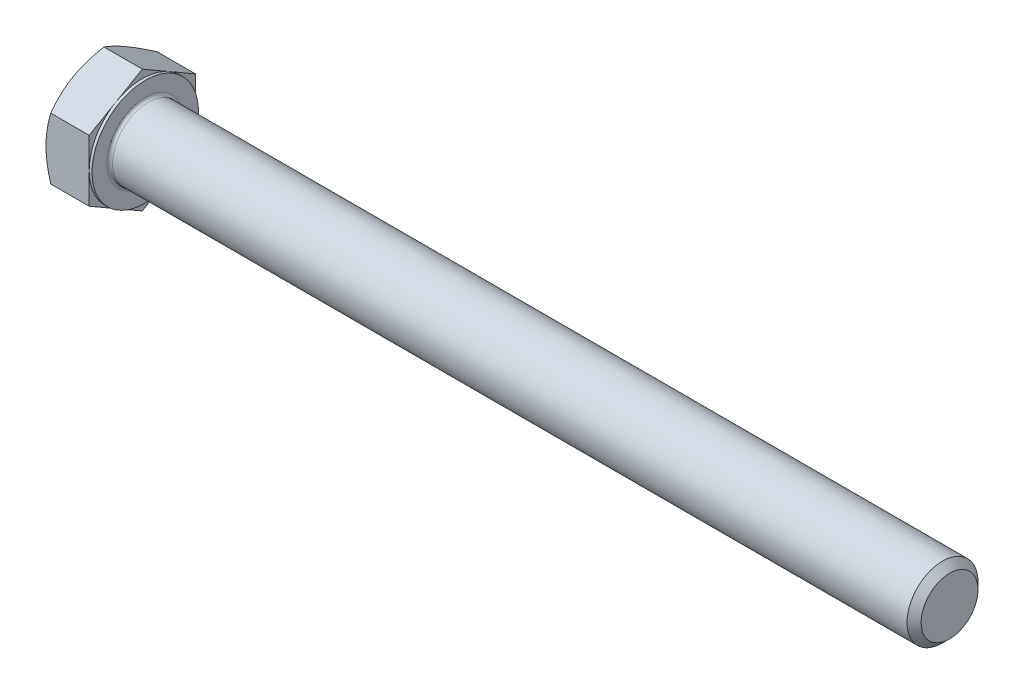
ISO-10303-21;
HEADER;
FILE_DESCRIPTION(('STEP AP214'),'2;1');
FILE_NAME('part.step','',(''),(''),'','','');
FILE_SCHEMA(('AUTOMOTIVE_DESIGN { 1 0 10303 214 1 1 1 1 }'));
ENDSEC;
DATA;
#1=APPLICATION_CONTEXT('core data for automotive mechanical design processes');
#2=APPLICATION_PROTOCOL_DEFINITION('international standard','automotive_design',2000,#1);
#3=PRODUCT_CONTEXT('',#1,'mechanical');
#4=PRODUCT('Part','Part','',(#3));
#5=PRODUCT_RELATED_PRODUCT_CATEGORY('part','',(#4));
#6=PRODUCT_DEFINITION_FORMATION('','',#4);
#7=PRODUCT_DEFINITION_CONTEXT('part definition',#1,'design');
#8=PRODUCT_DEFINITION('design','',#6,#7);
#9=PRODUCT_DEFINITION_SHAPE('','',#8);
#10=(LENGTH_UNIT() NAMED_UNIT(*) SI_UNIT(.MILLI.,.METRE.));
#11=(NAMED_UNIT(*) PLANE_ANGLE_UNIT() SI_UNIT($,.RADIAN.));
#12=(NAMED_UNIT(*) SI_UNIT($,.STERADIAN.) SOLID_ANGLE_UNIT());
#13=UNCERTAINTY_MEASURE_WITH_UNIT(LENGTH_MEASURE(1.E-05),#10,'distance_accuracy_value','');
#14=(GEOMETRIC_REPRESENTATION_CONTEXT(3) GLOBAL_UNCERTAINTY_ASSIGNED_CONTEXT((#13)) GLOBAL_UNIT_ASSIGNED_CONTEXT((#10,
#11,#12)) REPRESENTATION_CONTEXT('',''));
#15=CARTESIAN_POINT('',(0.,0.,0.));
#16=DIRECTION('',(0.,0.,1.));
#17=DIRECTION('',(1.,0.,0.));
#18=AXIS2_PLACEMENT_3D('',#15,#16,#17);
#19=CARTESIAN_POINT('',(0.,8.24155962262808,0.));
#20=DIRECTION('',(1.,0.,0.));
#21=DIRECTION('',(0.,0.,-1.));
#22=AXIS2_PLACEMENT_3D('',#19,#20,#21);
#23=PLANE('',#22);
#24=CARTESIAN_POINT('',(0.,0.,0.));
#25=DIRECTION('',(1.,0.,0.));
#26=DIRECTION('',(0.,0.,-1.));
#27=AXIS2_PLACEMENT_3D('',#24,#25,#26);
#28=CIRCLE('',#27,7.1374);
#29=CARTESIAN_POINT('',(0.,-6.18116971697105,-3.56870000000001));
#30=VERTEX_POINT('',#29);
#31=CARTESIAN_POINT('',(0.,0.,-7.1374));
#32=VERTEX_POINT('',#31);
#33=EDGE_CURVE('E141',#30,#32,#28,.T.);
#34=ORIENTED_EDGE('',*,*,#33,.F.);
#35=CARTESIAN_POINT('',(0.,0.,0.));
#36=DIRECTION('',(1.,0.,0.));
#37=DIRECTION('',(0.,0.,-1.));
#38=AXIS2_PLACEMENT_3D('',#35,#36,#37);
#39=CIRCLE('',#38,7.1374);
#40=CARTESIAN_POINT('',(0.,-6.18116971697106,3.56870000000001));
#41=VERTEX_POINT('',#40);
#42=EDGE_CURVE('E138',#41,#30,#39,.T.);
#43=ORIENTED_EDGE('',*,*,#42,.F.);
#44=CARTESIAN_POINT('',(0.,0.,0.));
#45=DIRECTION('',(1.,0.,0.));
#46=DIRECTION('',(0.,0.,-1.));
#47=AXIS2_PLACEMENT_3D('',#44,#45,#46);
#48=CIRCLE('',#47,7.1374);
#49=CARTESIAN_POINT('',(0.,0.,7.1374));
#50=VERTEX_POINT('',#49);
#51=EDGE_CURVE('E494',#50,#41,#48,.T.);
#52=ORIENTED_EDGE('',*,*,#51,.F.);
#53=CARTESIAN_POINT('',(0.,0.,0.));
#54=DIRECTION('',(1.,0.,0.));
#55=DIRECTION('',(0.,0.,-1.));
#56=AXIS2_PLACEMENT_3D('',#53,#54,#55);
#57=CIRCLE('',#56,7.1374);
#58=CARTESIAN_POINT('',(0.,6.18116971697105,3.56870000000001));
#59=VERTEX_POINT('',#58);
#60=EDGE_CURVE('E207',#59,#50,#57,.T.);
#61=ORIENTED_EDGE('',*,*,#60,.F.);
#62=CARTESIAN_POINT('',(0.,0.,0.));
#63=DIRECTION('',(1.,0.,0.));
#64=DIRECTION('',(0.,0.,-1.));
#65=AXIS2_PLACEMENT_3D('',#62,#63,#64);
#66=CIRCLE('',#65,7.1374);
#67=CARTESIAN_POINT('',(0.,6.18116971697105,-3.56870000000001));
#68=VERTEX_POINT('',#67);
#69=EDGE_CURVE('E493',#68,#59,#66,.T.);
#70=ORIENTED_EDGE('',*,*,#69,.F.);
#71=CARTESIAN_POINT('',(0.,0.,0.));
#72=DIRECTION('',(1.,0.,0.));
#73=DIRECTION('',(0.,0.,-1.));
#74=AXIS2_PLACEMENT_3D('',#71,#72,#73);
#75=CIRCLE('',#74,7.1374);
#76=EDGE_CURVE('E144',#32,#68,#75,.T.);
#77=ORIENTED_EDGE('',*,*,#76,.F.);
#78=EDGE_LOOP('',(#34,#43,#52,#61,#70,#77));
#79=FACE_BOUND('',#78,.T.);
#80=ADVANCED_FACE('F16',(#79),#23,.F.);
#81=CARTESIAN_POINT('',(0.641311776484754,0.,0.));
#82=DIRECTION('',(1.,0.,0.));
#83=DIRECTION('',(0.,0.,-1.));
#84=AXIS2_PLACEMENT_3D('',#81,#82,#83);
#85=CONICAL_SURFACE('',#84,8.24818458036387,1.0471975511966);
#86=ORIENTED_EDGE('',*,*,#42,.T.);
#87=CARTESIAN_POINT('',(0.,-6.18116971697106,-3.56870000000002));
#88=CARTESIAN_POINT('',(-2.91702878281906E-05,-6.26862170985652,-3.41722870509925));
#89=CARTESIAN_POINT('',(0.00371114889844038,-6.35606948988297,-3.26576470708432));
#90=CARTESIAN_POINT('',(0.0185139577467835,-6.53079334497843,-2.9631341127647));
#91=CARTESIAN_POINT('',(0.0295749978503088,-6.61806945060963,-2.81196746352471));
#92=CARTESIAN_POINT('',(0.0587296036169501,-6.7918862225359,-2.5109079833408));
#93=CARTESIAN_POINT('',(0.0767877659737066,-6.87842838481195,-2.3610125612818));
#94=CARTESIAN_POINT('',(0.119548178265526,-7.05110039256495,-2.06193587080869));
#95=CARTESIAN_POINT('',(0.144250603082628,-7.13723022712836,-1.91275462129736));
#96=CARTESIAN_POINT('',(0.227561148311189,-7.39464422393007,-1.46690050025742));
#97=CARTESIAN_POINT('',(0.295412992760169,-7.56518058886256,-1.17152285165624));
#98=CARTESIAN_POINT('',(0.451896700790797,-7.90478678087675,-0.583307672522674));
#99=CARTESIAN_POINT('',(0.540632343376944,-8.07384476218822,-0.290490659466179));
#100=CARTESIAN_POINT('',(0.637486855352638,-8.2415596226281,0.));
#101=B_SPLINE_CURVE_WITH_KNOTS('',3,(#87,#88,#89,#90,#91,#92,#93,#94,#95,#96,#97,#98,#99,#100),
.UNSPECIFIED.,.F.,.F.,(4,2,2,2,2,2,4),(0.,0.524658409500519,1.04921296370403,1.5711473776056,
2.09309553056225,3.13562382142666,4.18344647054619),.UNSPECIFIED.);
#102=CARTESIAN_POINT('',(0.637486855352637,-8.2415596226281,0.));
#103=VERTEX_POINT('',#102);
#104=EDGE_CURVE('E158',#30,#103,#101,.T.);
#105=ORIENTED_EDGE('',*,*,#104,.T.);
#106=CARTESIAN_POINT('',(0.637486855352637,-8.2415596226281,0.));
#107=CARTESIAN_POINT('',(0.540632343376944,-8.07384476218822,0.290490659466181));
#108=CARTESIAN_POINT('',(0.451896700790797,-7.90478678087675,0.583307672522676));
#109=CARTESIAN_POINT('',(0.295412992760169,-7.56518058886257,1.17152285165624));
#110=CARTESIAN_POINT('',(0.227561148311189,-7.39464422393008,1.46690050025742));
#111=CARTESIAN_POINT('',(0.14425060308263,-7.13723022712836,1.91275462129736));
#112=CARTESIAN_POINT('',(0.119548178265528,-7.05110039256495,2.06193587080869));
#113=CARTESIAN_POINT('',(0.0767877659737086,-6.87842838481196,2.3610125612818));
#114=CARTESIAN_POINT('',(0.0587296036169518,-6.7918862225359,2.5109079833408));
#115=CARTESIAN_POINT('',(0.0295749978503104,-6.61806945060963,2.81196746352471));
#116=CARTESIAN_POINT('',(0.0185139577467855,-6.53079334497843,2.9631341127647));
#117=CARTESIAN_POINT('',(0.00371114889844278,-6.35606948988298,3.26576470708432));
#118=CARTESIAN_POINT('',(-2.91702878256121E-05,-6.26862170985652,3.41722870509925));
#119=CARTESIAN_POINT('',(0.,-6.18116971697107,3.56870000000002));
#120=B_SPLINE_CURVE_WITH_KNOTS('',3,(#106,#107,#108,#109,#110,#111,#112,#113,#114,#115,#116,
#117,#118,#119),.UNSPECIFIED.,.F.,.F.,(4,2,2,2,2,2,4),(0.,1.04782264911953,2.09035093998394,
2.61229909294058,3.13423350684215,3.65878806104566,4.18344647054618),.UNSPECIFIED.);
#121=EDGE_CURVE('E164',#103,#41,#120,.T.);
#122=ORIENTED_EDGE('',*,*,#121,.T.);
#123=EDGE_LOOP('',(#86,#105,#122));
#124=FACE_BOUND('',#123,.T.);
#125=ADVANCED_FACE('F162',(#124),#85,.T.);
#126=CARTESIAN_POINT('',(0.641311776484743,0.,0.));
#127=DIRECTION('',(1.,0.,0.));
#128=DIRECTION('',(0.,0.,-1.));
#129=AXIS2_PLACEMENT_3D('',#126,#127,#128);
#130=CONICAL_SURFACE('',#129,8.24818458036385,1.0471975511966);
#131=ORIENTED_EDGE('',*,*,#33,.T.);
#132=CARTESIAN_POINT('',(0.,0.,-7.1374));
#133=CARTESIAN_POINT('',(-2.91702878363875E-05,-0.174903985770917,-7.1374));
#134=CARTESIAN_POINT('',(0.0037111488984321,-0.349799545823828,-7.1374));
#135=CARTESIAN_POINT('',(0.0185139577467752,-0.699247256014727,-7.1374));
#136=CARTESIAN_POINT('',(0.0295749978503004,-0.873799467277128,-7.1374));
#137=CARTESIAN_POINT('',(0.0587296036169417,-1.22143301112966,-7.1374));
#138=CARTESIAN_POINT('',(0.0767877659736981,-1.39451733568178,-7.1374));
#139=CARTESIAN_POINT('',(0.119548178265518,-1.73986135118776,-7.1374));
#140=CARTESIAN_POINT('',(0.144250603082619,-1.91212102031459,-7.1374));
#141=CARTESIAN_POINT('',(0.227561148311179,-2.42694901391801,-7.1374));
#142=CARTESIAN_POINT('',(0.295412992760159,-2.76802174378299,-7.1374));
#143=CARTESIAN_POINT('',(0.451896700790786,-3.44723412781136,-7.1374));
#144=CARTESIAN_POINT('',(0.540632343376933,-3.7853500904343,-7.1374));
#145=CARTESIAN_POINT('',(0.637486855352627,-4.12077981131404,-7.1374));
#146=B_SPLINE_CURVE_WITH_KNOTS('',3,(#132,#133,#134,#135,#136,#137,#138,#139,#140,#141,#142,
#143,#144,#145),.UNSPECIFIED.,.F.,.F.,(4,2,2,2,2,2,4),(0.,0.524658409500517,1.04921296370403,
1.5711473776056,2.09309553056224,3.13562382142665,4.18344647054617),.UNSPECIFIED.);
#147=CARTESIAN_POINT('',(0.637486855352626,-4.12077981131404,-7.1374));
#148=VERTEX_POINT('',#147);
#149=EDGE_CURVE('E153',#32,#148,#146,.T.);
#150=ORIENTED_EDGE('',*,*,#149,.T.);
#151=CARTESIAN_POINT('',(0.637486855352626,-4.12077981131404,-7.1374));
#152=CARTESIAN_POINT('',(0.540632343376933,-4.28849467175391,-6.84690934053382));
#153=CARTESIAN_POINT('',(0.451896700790788,-4.45755265306538,-6.55409232747733));
#154=CARTESIAN_POINT('',(0.295412992760162,-4.79715884507957,-5.96587714834377));
#155=CARTESIAN_POINT('',(0.227561148311183,-4.96769521001206,-5.6704994997426));
#156=CARTESIAN_POINT('',(0.144250603082625,-5.22510920681377,-5.22464537870266));
#157=CARTESIAN_POINT('',(0.119548178265524,-5.31123904137718,-5.07546412919133));
#158=CARTESIAN_POINT('',(0.076787765973705,-5.48391104913017,-4.77638743871822));
#159=CARTESIAN_POINT('',(0.0587296036169484,-5.57045321140623,-4.62649201665922));
#160=CARTESIAN_POINT('',(0.0295749978503076,-5.7442699833325,-4.32543253647532));
#161=CARTESIAN_POINT('',(0.0185139577467831,-5.8315460889637,-4.17426588723533));
#162=CARTESIAN_POINT('',(0.00371114889844091,-6.00626994405915,-3.87163529291571));
#163=CARTESIAN_POINT('',(-2.91702878274496E-05,-6.0937177240856,-3.72017129490078));
#164=CARTESIAN_POINT('',(0.,-6.18116971697106,-3.56870000000002));
#165=B_SPLINE_CURVE_WITH_KNOTS('',3,(#151,#152,#153,#154,#155,#156,#157,#158,#159,#160,#161,
#162,#163,#164),.UNSPECIFIED.,.F.,.F.,(4,2,2,2,2,2,4),(0.,1.04782264911952,2.09035093998392,
2.61229909294056,3.13423350684212,3.65878806104563,4.18344647054614),.UNSPECIFIED.);
#166=EDGE_CURVE('E151',#148,#30,#165,.T.);
#167=ORIENTED_EDGE('',*,*,#166,.T.);
#168=EDGE_LOOP('',(#131,#150,#167));
#169=FACE_BOUND('',#168,.T.);
#170=ADVANCED_FACE('F152',(#169),#130,.T.);
#171=CARTESIAN_POINT('',(0.641311776484739,0.,0.));
#172=DIRECTION('',(1.,0.,0.));
#173=DIRECTION('',(0.,0.,-1.));
#174=AXIS2_PLACEMENT_3D('',#171,#172,#173);
#175=CONICAL_SURFACE('',#174,8.24818458036384,1.0471975511966);
#176=CARTESIAN_POINT('',(0.637486855352624,4.12077981131404,-7.1374));
#177=CARTESIAN_POINT('',(0.540632343376931,3.78535009043429,-7.1374));
#178=CARTESIAN_POINT('',(0.451896700790785,3.44723412781136,-7.1374));
#179=CARTESIAN_POINT('',(0.295412992760157,2.76802174378299,-7.1374));
#180=CARTESIAN_POINT('',(0.227561148311177,2.42694901391801,-7.1374));
#181=CARTESIAN_POINT('',(0.144250603082619,1.91212102031458,-7.1374));
#182=CARTESIAN_POINT('',(0.119548178265517,1.73986135118776,-7.1374));
#183=CARTESIAN_POINT('',(0.076787765973698,1.39451733568178,-7.1374));
#184=CARTESIAN_POINT('',(0.0587296036169412,1.22143301112966,-7.1374));
#185=CARTESIAN_POINT('',(0.0295749978502998,0.873799467277126,-7.1374));
#186=CARTESIAN_POINT('',(0.018513957746775,0.699247256014726,-7.1374));
#187=CARTESIAN_POINT('',(0.0037111488984325,0.349799545823827,-7.1374));
#188=CARTESIAN_POINT('',(-2.91702878357943E-05,0.174903985770916,-7.1374));
#189=CARTESIAN_POINT('',(0.,0.,-7.1374));
#190=B_SPLINE_CURVE_WITH_KNOTS('',3,(#176,#177,#178,#179,#180,#181,#182,#183,#184,#185,#186,
#187,#188,#189),.UNSPECIFIED.,.F.,.F.,(4,2,2,2,2,2,4),(0.,1.04782264911952,2.09035093998393,
2.61229909294057,3.13423350684214,3.65878806104565,4.18344647054616),.UNSPECIFIED.);
#191=CARTESIAN_POINT('',(0.637486855352624,4.12077981131404,-7.1374));
#192=VERTEX_POINT('',#191);
#193=EDGE_CURVE('E177',#192,#32,#190,.T.);
#194=ORIENTED_EDGE('',*,*,#193,.T.);
#195=ORIENTED_EDGE('',*,*,#76,.T.);
#196=CARTESIAN_POINT('',(0.,6.18116971697105,-3.56870000000001));
#197=CARTESIAN_POINT('',(-2.9170287832926E-05,6.0937177240856,-3.72017129490077));
#198=CARTESIAN_POINT('',(0.00371114889843545,6.00626994405914,-3.8716352929157));
#199=CARTESIAN_POINT('',(0.018513957746778,5.83154608896369,-4.17426588723532));
#200=CARTESIAN_POINT('',(0.0295749978503029,5.74426998333249,-4.32543253647531));
#201=CARTESIAN_POINT('',(0.0587296036169437,5.57045321140622,-4.62649201665922));
#202=CARTESIAN_POINT('',(0.0767877659737001,5.48391104913017,-4.77638743871822));
#203=CARTESIAN_POINT('',(0.119548178265519,5.31123904137718,-5.07546412919132));
#204=CARTESIAN_POINT('',(0.144250603082621,5.22510920681376,-5.22464537870265));
#205=CARTESIAN_POINT('',(0.22756114831118,4.96769521001205,-5.67049949974259));
#206=CARTESIAN_POINT('',(0.295412992760159,4.79715884507956,-5.96587714834377));
#207=CARTESIAN_POINT('',(0.451896700790785,4.45755265306538,-6.55409232747733));
#208=CARTESIAN_POINT('',(0.540632343376931,4.28849467175391,-6.84690934053382));
#209=CARTESIAN_POINT('',(0.637486855352624,4.12077981131404,-7.1374));
#210=B_SPLINE_CURVE_WITH_KNOTS('',3,(#196,#197,#198,#199,#200,#201,#202,#203,#204,#205,#206,
#207,#208,#209),.UNSPECIFIED.,.F.,.F.,(4,2,2,2,2,2,4),(0.,0.524658409500515,1.04921296370402,
1.57114737760559,2.09309553056223,3.13562382142663,4.18344647054615),.UNSPECIFIED.);
#211=EDGE_CURVE('E287',#68,#192,#210,.T.);
#212=ORIENTED_EDGE('',*,*,#211,.T.);
#213=EDGE_LOOP('',(#194,#195,#212));
#214=FACE_BOUND('',#213,.T.);
#215=ADVANCED_FACE('F276',(#214),#175,.T.);
#216=CARTESIAN_POINT('',(0.641311776484745,0.,0.));
#217=DIRECTION('',(1.,0.,0.));
#218=DIRECTION('',(0.,0.,-1.));
#219=AXIS2_PLACEMENT_3D('',#216,#217,#218);
#220=CONICAL_SURFACE('',#219,8.24818458036385,1.0471975511966);
#221=CARTESIAN_POINT('',(0.637486855352629,8.24155962262808,0.));
#222=CARTESIAN_POINT('',(0.540632343376936,8.07384476218821,-0.290490659466181));
#223=CARTESIAN_POINT('',(0.45189670079079,7.90478678087674,-0.583307672522675));
#224=CARTESIAN_POINT('',(0.295412992760162,7.56518058886255,-1.17152285165624));
#225=CARTESIAN_POINT('',(0.227561148311182,7.39464422393006,-1.46690050025742));
#226=CARTESIAN_POINT('',(0.144250603082622,7.13723022712835,-1.91275462129736));
#227=CARTESIAN_POINT('',(0.119548178265521,7.05110039256494,-2.06193587080869));
#228=CARTESIAN_POINT('',(0.076787765973701,6.87842838481194,-2.3610125612818));
#229=CARTESIAN_POINT('',(0.0587296036169442,6.79188622253589,-2.5109079833408));
#230=CARTESIAN_POINT('',(0.0295749978503029,6.61806945060962,-2.81196746352471));
#231=CARTESIAN_POINT('',(0.018513957746778,6.53079334497842,-2.96313411276469));
#232=CARTESIAN_POINT('',(0.00371114889843529,6.35606948988297,-3.26576470708432));
#233=CARTESIAN_POINT('',(-2.91702878331806E-05,6.26862170985651,-3.41722870509924));
#234=CARTESIAN_POINT('',(0.,6.18116971697105,-3.56870000000001));
#235=B_SPLINE_CURVE_WITH_KNOTS('',3,(#221,#222,#223,#224,#225,#226,#227,#228,#229,#230,#231,
#232,#233,#234),.UNSPECIFIED.,.F.,.F.,(4,2,2,2,2,2,4),(0.,1.04782264911952,2.09035093998393,
2.61229909294058,3.13423350684215,3.65878806104566,4.18344647054617),.UNSPECIFIED.);
#236=CARTESIAN_POINT('',(0.637486855352629,8.24155962262808,0.));
#237=VERTEX_POINT('',#236);
#238=EDGE_CURVE('E281',#237,#68,#235,.T.);
#239=ORIENTED_EDGE('',*,*,#238,.T.);
#240=ORIENTED_EDGE('',*,*,#69,.T.);
#241=CARTESIAN_POINT('',(0.,6.18116971697105,3.56870000000001));
#242=CARTESIAN_POINT('',(-2.9170287834756E-05,6.26862170985651,3.41722870509925));
#243=CARTESIAN_POINT('',(0.00371114889843365,6.35606948988296,3.26576470708432));
#244=CARTESIAN_POINT('',(0.018513957746776,6.53079334497841,2.9631341127647));
#245=CARTESIAN_POINT('',(0.0295749978503007,6.61806945060961,2.81196746352471));
#246=CARTESIAN_POINT('',(0.0587296036169419,6.79188622253588,2.5109079833408));
#247=CARTESIAN_POINT('',(0.0767877659736988,6.87842838481194,2.3610125612818));
#248=CARTESIAN_POINT('',(0.119548178265519,7.05110039256493,2.06193587080869));
#249=CARTESIAN_POINT('',(0.14425060308262,7.13723022712835,1.91275462129736));
#250=CARTESIAN_POINT('',(0.22756114831118,7.39464422393006,1.46690050025742));
#251=CARTESIAN_POINT('',(0.295412992760161,7.56518058886255,1.17152285165624));
#252=CARTESIAN_POINT('',(0.451896700790789,7.90478678087674,0.583307672522675));
#253=CARTESIAN_POINT('',(0.540632343376935,8.07384476218821,0.29049065946618));
#254=CARTESIAN_POINT('',(0.637486855352629,8.24155962262808,0.));
#255=B_SPLINE_CURVE_WITH_KNOTS('',3,(#241,#242,#243,#244,#245,#246,#247,#248,#249,#250,#251,
#252,#253,#254),.UNSPECIFIED.,.F.,.F.,(4,2,2,2,2,2,4),(0.,0.524658409500518,1.04921296370403,
1.5711473776056,2.09309553056224,3.13562382142665,4.18344647054618),.UNSPECIFIED.);
#256=EDGE_CURVE('E267',#59,#237,#255,.T.);
#257=ORIENTED_EDGE('',*,*,#256,.T.);
#258=EDGE_LOOP('',(#239,#240,#257));
#259=FACE_BOUND('',#258,.T.);
#260=ADVANCED_FACE('F273',(#259),#220,.T.);
#261=CARTESIAN_POINT('',(0.641311776484745,0.,0.));
#262=DIRECTION('',(1.,0.,0.));
#263=DIRECTION('',(0.,0.,-1.));
#264=AXIS2_PLACEMENT_3D('',#261,#262,#263);
#265=CONICAL_SURFACE('',#264,8.24818458036385,1.0471975511966);
#266=ORIENTED_EDGE('',*,*,#51,.T.);
#267=CARTESIAN_POINT('',(0.,-6.18116971697107,3.56870000000002));
#268=CARTESIAN_POINT('',(-2.9170287825595E-05,-6.09371772408561,3.72017129490078));
#269=CARTESIAN_POINT('',(0.00371114889844298,-6.00626994405915,3.87163529291571));
#270=CARTESIAN_POINT('',(0.0185139577467859,-5.8315460889637,4.17426588723533));
#271=CARTESIAN_POINT('',(0.0295749978503109,-5.7442699833325,4.32543253647531));
#272=CARTESIAN_POINT('',(0.0587296036169516,-5.57045321140624,4.62649201665922));
#273=CARTESIAN_POINT('',(0.0767877659737078,-5.48391104913018,4.77638743871822));
#274=CARTESIAN_POINT('',(0.119548178265527,-5.31123904137719,5.07546412919133));
#275=CARTESIAN_POINT('',(0.144250603082628,-5.22510920681378,5.22464537870266));
#276=CARTESIAN_POINT('',(0.227561148311187,-4.96769521001206,5.6704994997426));
#277=CARTESIAN_POINT('',(0.295412992760166,-4.79715884507958,5.96587714834377));
#278=CARTESIAN_POINT('',(0.451896700790791,-4.45755265306539,6.55409232747733));
#279=CARTESIAN_POINT('',(0.540632343376936,-4.28849467175392,6.84690934053382));
#280=CARTESIAN_POINT('',(0.637486855352629,-4.12077981131405,7.1374));
#281=B_SPLINE_CURVE_WITH_KNOTS('',3,(#267,#268,#269,#270,#271,#272,#273,#274,#275,#276,#277,
#278,#279,#280),.UNSPECIFIED.,.F.,.F.,(4,2,2,2,2,2,4),(0.,0.524658409500513,1.04921296370402,
1.57114737760559,2.09309553056223,3.13562382142663,4.18344647054615),.UNSPECIFIED.);
#282=CARTESIAN_POINT('',(0.637486855352629,-4.12077981131405,7.1374));
#283=VERTEX_POINT('',#282);
#284=EDGE_CURVE('E159',#41,#283,#281,.T.);
#285=ORIENTED_EDGE('',*,*,#284,.T.);
#286=CARTESIAN_POINT('',(0.637486855352629,-4.12077981131405,7.1374));
#287=CARTESIAN_POINT('',(0.540632343376935,-3.78535009043431,7.1374));
#288=CARTESIAN_POINT('',(0.451896700790788,-3.44723412781137,7.1374));
#289=CARTESIAN_POINT('',(0.29541299276016,-2.768021743783,7.1374));
#290=CARTESIAN_POINT('',(0.22756114831118,-2.42694901391802,7.1374));
#291=CARTESIAN_POINT('',(0.14425060308262,-1.91212102031459,7.1374));
#292=CARTESIAN_POINT('',(0.119548178265519,-1.73986135118776,7.1374));
#293=CARTESIAN_POINT('',(0.0767877659736989,-1.39451733568178,7.1374));
#294=CARTESIAN_POINT('',(0.0587296036169421,-1.22143301112967,7.1374));
#295=CARTESIAN_POINT('',(0.0295749978503008,-0.87379946727713,7.1374));
#296=CARTESIAN_POINT('',(0.018513957746776,-0.699247256014728,7.1374));
#297=CARTESIAN_POINT('',(0.00371114889843334,-0.349799545823828,7.1374));
#298=CARTESIAN_POINT('',(-2.91702878350887E-05,-0.174903985770916,7.1374));
#299=CARTESIAN_POINT('',(0.,0.,7.1374));
#300=B_SPLINE_CURVE_WITH_KNOTS('',3,(#286,#287,#288,#289,#290,#291,#292,#293,#294,#295,#296,
#297,#298,#299),.UNSPECIFIED.,.F.,.F.,(4,2,2,2,2,2,4),(0.,1.04782264911953,2.09035093998394,
2.61229909294058,3.13423350684215,3.65878806104566,4.18344647054618),.UNSPECIFIED.);
#301=EDGE_CURVE('E245',#283,#50,#300,.T.);
#302=ORIENTED_EDGE('',*,*,#301,.T.);
#303=EDGE_LOOP('',(#266,#285,#302));
#304=FACE_BOUND('',#303,.T.);
#305=ADVANCED_FACE('F222',(#304),#265,.T.);
#306=CARTESIAN_POINT('',(0.641311776484738,0.,0.));
#307=DIRECTION('',(1.,0.,0.));
#308=DIRECTION('',(0.,0.,-1.));
#309=AXIS2_PLACEMENT_3D('',#306,#307,#308);
#310=CONICAL_SURFACE('',#309,8.24818458036384,1.0471975511966);
#311=CARTESIAN_POINT('',(0.637486855352622,4.12077981131403,7.1374));
#312=CARTESIAN_POINT('',(0.540632343376929,4.2884946717539,6.84690934053382));
#313=CARTESIAN_POINT('',(0.451896700790783,4.45755265306537,6.55409232747733));
#314=CARTESIAN_POINT('',(0.295412992760157,4.79715884507955,5.96587714834377));
#315=CARTESIAN_POINT('',(0.227561148311178,4.96769521001204,5.67049949974259));
#316=CARTESIAN_POINT('',(0.144250603082619,5.22510920681376,5.22464537870266));
#317=CARTESIAN_POINT('',(0.119548178265518,5.31123904137717,5.07546412919132));
#318=CARTESIAN_POINT('',(0.0767877659736985,5.48391104913016,4.77638743871822));
#319=CARTESIAN_POINT('',(0.0587296036169418,5.57045321140622,4.62649201665922));
#320=CARTESIAN_POINT('',(0.0295749978503007,5.74426998333248,4.32543253647531));
#321=CARTESIAN_POINT('',(0.0185139577467759,5.83154608896368,4.17426588723532));
#322=CARTESIAN_POINT('',(0.00371114889843337,6.00626994405913,3.8716352929157));
#323=CARTESIAN_POINT('',(-2.91702878350612E-05,6.09371772408559,3.72017129490078));
#324=CARTESIAN_POINT('',(0.,6.18116971697105,3.56870000000001));
#325=B_SPLINE_CURVE_WITH_KNOTS('',3,(#311,#312,#313,#314,#315,#316,#317,#318,#319,#320,#321,
#322,#323,#324),.UNSPECIFIED.,.F.,.F.,(4,2,2,2,2,2,4),(0.,1.04782264911952,2.09035093998392,
2.61229909294056,3.13423350684213,3.65878806104564,4.18344647054615),.UNSPECIFIED.);
#326=CARTESIAN_POINT('',(0.637486855352622,4.12077981131403,7.1374));
#327=VERTEX_POINT('',#326);
#328=EDGE_CURVE('E228',#327,#59,#325,.T.);
#329=ORIENTED_EDGE('',*,*,#328,.T.);
#330=ORIENTED_EDGE('',*,*,#60,.T.);
#331=CARTESIAN_POINT('',(0.,0.,7.1374));
#332=CARTESIAN_POINT('',(-2.91702878350349E-05,0.174903985770917,7.1374));
#333=CARTESIAN_POINT('',(0.00371114889843339,0.349799545823827,7.1374));
#334=CARTESIAN_POINT('',(0.0185139577467758,0.699247256014725,7.1374));
#335=CARTESIAN_POINT('',(0.0295749978503005,0.873799467277125,7.1374));
#336=CARTESIAN_POINT('',(0.0587296036169414,1.22143301112966,7.1374));
#337=CARTESIAN_POINT('',(0.076787765973698,1.39451733568177,7.1374));
#338=CARTESIAN_POINT('',(0.119548178265517,1.73986135118775,7.1374));
#339=CARTESIAN_POINT('',(0.144250603082619,1.91212102031458,7.1374));
#340=CARTESIAN_POINT('',(0.227561148311177,2.426949013918,7.1374));
#341=CARTESIAN_POINT('',(0.295412992760157,2.76802174378298,7.1374));
#342=CARTESIAN_POINT('',(0.451896700790783,3.44723412781135,7.1374));
#343=CARTESIAN_POINT('',(0.540632343376929,3.78535009043429,7.1374));
#344=CARTESIAN_POINT('',(0.637486855352622,4.12077981131403,7.1374));
#345=B_SPLINE_CURVE_WITH_KNOTS('',3,(#331,#332,#333,#334,#335,#336,#337,#338,#339,#340,#341,
#342,#343,#344),.UNSPECIFIED.,.F.,.F.,(4,2,2,2,2,2,4),(0.,0.524658409500515,1.04921296370402,
1.57114737760559,2.09309553056223,3.13562382142663,4.18344647054615),.UNSPECIFIED.);
#346=EDGE_CURVE('E236',#50,#327,#345,.T.);
#347=ORIENTED_EDGE('',*,*,#346,.T.);
#348=EDGE_LOOP('',(#329,#330,#347));
#349=FACE_BOUND('',#348,.T.);
#350=ADVANCED_FACE('F217',(#349),#310,.T.);
#351=CARTESIAN_POINT('',(6.1722,-8.2415596226281,0.));
#352=DIRECTION('',(0.,0.866025403784438,-0.500000000000001));
#353=DIRECTION('',(0.,0.500000000000001,0.866025403784438));
#354=AXIS2_PLACEMENT_3D('',#351,#352,#353);
#355=PLANE('',#354);
#356=DIRECTION('',(-1.,0.,0.));
#357=VECTOR('',#356,1.);
#358=CARTESIAN_POINT('',(6.1722,-4.12077981131405,7.1374));
#359=LINE('',#358,#357);
#360=CARTESIAN_POINT('',(5.7912,-4.12077981131405,7.1374));
#361=VERTEX_POINT('',#360);
#362=EDGE_CURVE('E412',#361,#283,#359,.T.);
#363=ORIENTED_EDGE('',*,*,#362,.T.);
#364=ORIENTED_EDGE('',*,*,#284,.F.);
#365=ORIENTED_EDGE('',*,*,#121,.F.);
#366=DIRECTION('',(1.,0.,0.));
#367=VECTOR('',#366,1.);
#368=CARTESIAN_POINT('',(6.1722,-8.2415596226281,0.));
#369=LINE('',#368,#367);
#370=CARTESIAN_POINT('',(5.7912,-8.2415596226281,0.));
#371=VERTEX_POINT('',#370);
#372=EDGE_CURVE('E171',#103,#371,#369,.T.);
#373=ORIENTED_EDGE('',*,*,#372,.T.);
#374=DIRECTION('',(0.,-0.500000000000005,-0.866025403784436));
#375=VECTOR('',#374,1.);
#376=CARTESIAN_POINT('',(5.7912,-6.18116971697105,3.5687));
#377=LINE('',#376,#375);
#378=CARTESIAN_POINT('',(5.7912,-6.18116971697105,3.5687));
#379=VERTEX_POINT('',#378);
#380=EDGE_CURVE('E398',#379,#371,#377,.T.);
#381=ORIENTED_EDGE('',*,*,#380,.F.);
#382=DIRECTION('',(0.,-0.499999999999996,-0.866025403784441));
#383=VECTOR('',#382,1.);
#384=CARTESIAN_POINT('',(5.7912,-4.12077981131405,7.1374));
#385=LINE('',#384,#383);
#386=EDGE_CURVE('E402',#361,#379,#385,.T.);
#387=ORIENTED_EDGE('',*,*,#386,.F.);
#388=EDGE_LOOP('',(#363,#364,#365,#373,#381,#387));
#389=FACE_BOUND('',#388,.T.);
#390=ADVANCED_FACE('F213',(#389),#355,.F.);
#391=CARTESIAN_POINT('',(6.1722,-4.12077981131404,-7.1374));
#392=DIRECTION('',(0.,0.866025403784438,0.500000000000001));
#393=DIRECTION('',(0.,-0.500000000000001,0.866025403784438));
#394=AXIS2_PLACEMENT_3D('',#391,#392,#393);
#395=PLANE('',#394);
#396=ORIENTED_EDGE('',*,*,#372,.F.);
#397=ORIENTED_EDGE('',*,*,#104,.F.);
#398=ORIENTED_EDGE('',*,*,#166,.F.);
#399=DIRECTION('',(1.,0.,0.));
#400=VECTOR('',#399,1.);
#401=CARTESIAN_POINT('',(6.1722,-4.12077981131404,-7.1374));
#402=LINE('',#401,#400);
#403=CARTESIAN_POINT('',(5.7912,-4.12077981131404,-7.1374));
#404=VERTEX_POINT('',#403);
#405=EDGE_CURVE('E288',#148,#404,#402,.T.);
#406=ORIENTED_EDGE('',*,*,#405,.T.);
#407=DIRECTION('',(0.,0.499999999999998,-0.866025403784439));
#408=VECTOR('',#407,1.);
#409=CARTESIAN_POINT('',(5.7912,-6.18116971697105,-3.56870000000001));
#410=LINE('',#409,#408);
#411=CARTESIAN_POINT('',(5.7912,-6.18116971697104,-3.56870000000001));
#412=VERTEX_POINT('',#411);
#413=EDGE_CURVE('E390',#412,#404,#410,.T.);
#414=ORIENTED_EDGE('',*,*,#413,.F.);
#415=DIRECTION('',(0.,0.500000000000005,-0.866025403784436));
#416=VECTOR('',#415,1.);
#417=CARTESIAN_POINT('',(5.7912,-8.2415596226281,0.));
#418=LINE('',#417,#416);
#419=EDGE_CURVE('E394',#371,#412,#418,.T.);
#420=ORIENTED_EDGE('',*,*,#419,.F.);
#421=EDGE_LOOP('',(#396,#397,#398,#406,#414,#420));
#422=FACE_BOUND('',#421,.T.);
#423=ADVANCED_FACE('F169',(#422),#395,.F.);
#424=CARTESIAN_POINT('',(6.1722,4.12077981131404,-7.1374));
#425=DIRECTION('',(0.,0.,1.));
#426=DIRECTION('',(0.,-1.,0.));
#427=AXIS2_PLACEMENT_3D('',#424,#425,#426);
#428=PLANE('',#427);
#429=ORIENTED_EDGE('',*,*,#405,.F.);
#430=ORIENTED_EDGE('',*,*,#149,.F.);
#431=ORIENTED_EDGE('',*,*,#193,.F.);
#432=DIRECTION('',(1.,0.,0.));
#433=VECTOR('',#432,1.);
#434=CARTESIAN_POINT('',(6.1722,4.12077981131404,-7.1374));
#435=LINE('',#434,#433);
#436=CARTESIAN_POINT('',(5.7912,4.12077981131404,-7.1374));
#437=VERTEX_POINT('',#436);
#438=EDGE_CURVE('E418',#192,#437,#435,.T.);
#439=ORIENTED_EDGE('',*,*,#438,.T.);
#440=DIRECTION('',(0.,1.,0.));
#441=VECTOR('',#440,1.);
#442=CARTESIAN_POINT('',(5.7912,7.1374,-7.1374));
#443=LINE('',#442,#441);
#444=CARTESIAN_POINT('',(5.7912,0.,-7.1374));
#445=VERTEX_POINT('',#444);
#446=EDGE_CURVE('E378',#445,#437,#443,.T.);
#447=ORIENTED_EDGE('',*,*,#446,.F.);
#448=DIRECTION('',(0.,1.,0.));
#449=VECTOR('',#448,1.);
#450=CARTESIAN_POINT('',(5.7912,7.1374,-7.1374));
#451=LINE('',#450,#449);
#452=EDGE_CURVE('E386',#404,#445,#451,.T.);
#453=ORIENTED_EDGE('',*,*,#452,.F.);
#454=EDGE_LOOP('',(#429,#430,#431,#439,#447,#453));
#455=FACE_BOUND('',#454,.T.);
#456=ADVANCED_FACE('F296',(#455),#428,.F.);
#457=CARTESIAN_POINT('',(6.1722,4.12077981131404,-7.1374));
#458=DIRECTION('',(0.,-0.866025403784438,0.500000000000001));
#459=DIRECTION('',(0.,-0.500000000000001,-0.866025403784438));
#460=AXIS2_PLACEMENT_3D('',#457,#458,#459);
#461=PLANE('',#460);
#462=ORIENTED_EDGE('',*,*,#438,.F.);
#463=ORIENTED_EDGE('',*,*,#211,.F.);
#464=ORIENTED_EDGE('',*,*,#238,.F.);
#465=DIRECTION('',(1.,0.,0.));
#466=VECTOR('',#465,1.);
#467=CARTESIAN_POINT('',(6.1722,8.24155962262808,0.));
#468=LINE('',#467,#466);
#469=CARTESIAN_POINT('',(5.7912,8.24155962262808,0.));
#470=VERTEX_POINT('',#469);
#471=EDGE_CURVE('E272',#237,#470,#468,.T.);
#472=ORIENTED_EDGE('',*,*,#471,.T.);
#473=DIRECTION('',(0.,0.500000000000002,0.866025403784437));
#474=VECTOR('',#473,1.);
#475=CARTESIAN_POINT('',(5.7912,6.18116971697105,-3.56870000000001));
#476=LINE('',#475,#474);
#477=CARTESIAN_POINT('',(5.7912,6.18116971697105,-3.5687));
#478=VERTEX_POINT('',#477);
#479=EDGE_CURVE('E374',#478,#470,#476,.T.);
#480=ORIENTED_EDGE('',*,*,#479,.F.);
#481=DIRECTION('',(0.,0.5,0.866025403784439));
#482=VECTOR('',#481,1.);
#483=CARTESIAN_POINT('',(5.7912,4.12077981131404,-7.1374));
#484=LINE('',#483,#482);
#485=EDGE_CURVE('E382',#437,#478,#484,.T.);
#486=ORIENTED_EDGE('',*,*,#485,.F.);
#487=EDGE_LOOP('',(#462,#463,#464,#472,#480,#486));
#488=FACE_BOUND('',#487,.T.);
#489=ADVANCED_FACE('F263',(#488),#461,.F.);
#490=CARTESIAN_POINT('',(6.1722,8.24155962262808,0.));
#491=DIRECTION('',(0.,-0.866025403784438,-0.500000000000001));
#492=DIRECTION('',(0.,0.500000000000001,-0.866025403784438));
#493=AXIS2_PLACEMENT_3D('',#490,#491,#492);
#494=PLANE('',#493);
#495=ORIENTED_EDGE('',*,*,#471,.F.);
#496=ORIENTED_EDGE('',*,*,#256,.F.);
#497=ORIENTED_EDGE('',*,*,#328,.F.);
#498=DIRECTION('',(-1.,0.,0.));
#499=VECTOR('',#498,1.);
#500=CARTESIAN_POINT('',(6.1722,4.12077981131403,7.1374));
#501=LINE('',#500,#499);
#502=CARTESIAN_POINT('',(5.7912,4.12077981131403,7.1374));
#503=VERTEX_POINT('',#502);
#504=EDGE_CURVE('E244',#327,#503,#501,.F.);
#505=ORIENTED_EDGE('',*,*,#504,.T.);
#506=DIRECTION('',(0.,-0.500000000000001,0.866025403784438));
#507=VECTOR('',#506,1.);
#508=CARTESIAN_POINT('',(5.7912,6.18116971697105,3.56870000000001));
#509=LINE('',#508,#507);
#510=CARTESIAN_POINT('',(5.7912,6.18116971697104,3.56870000000001));
#511=VERTEX_POINT('',#510);
#512=EDGE_CURVE('E366',#511,#503,#509,.T.);
#513=ORIENTED_EDGE('',*,*,#512,.F.);
#514=DIRECTION('',(0.,-0.500000000000002,0.866025403784438));
#515=VECTOR('',#514,1.);
#516=CARTESIAN_POINT('',(5.7912,8.24155962262808,0.));
#517=LINE('',#516,#515);
#518=EDGE_CURVE('E370',#470,#511,#517,.T.);
#519=ORIENTED_EDGE('',*,*,#518,.F.);
#520=EDGE_LOOP('',(#495,#496,#497,#505,#513,#519));
#521=FACE_BOUND('',#520,.T.);
#522=ADVANCED_FACE('F256',(#521),#494,.F.);
#523=CARTESIAN_POINT('',(6.1722,4.12077981131403,7.1374));
#524=DIRECTION('',(0.,0.,-1.));
#525=DIRECTION('',(-1.,0.,0.));
#526=AXIS2_PLACEMENT_3D('',#523,#524,#525);
#527=PLANE('',#526);
#528=ORIENTED_EDGE('',*,*,#504,.F.);
#529=ORIENTED_EDGE('',*,*,#346,.F.);
#530=ORIENTED_EDGE('',*,*,#301,.F.);
#531=ORIENTED_EDGE('',*,*,#362,.F.);
#532=DIRECTION('',(0.,1.,0.));
#533=VECTOR('',#532,1.);
#534=CARTESIAN_POINT('',(5.7912,7.1374,7.1374));
#535=LINE('',#534,#533);
#536=CARTESIAN_POINT('',(5.7912,0.,7.1374));
#537=VERTEX_POINT('',#536);
#538=EDGE_CURVE('E406',#537,#361,#535,.F.);
#539=ORIENTED_EDGE('',*,*,#538,.F.);
#540=DIRECTION('',(0.,1.,0.));
#541=VECTOR('',#540,1.);
#542=CARTESIAN_POINT('',(5.7912,7.1374,7.1374));
#543=LINE('',#542,#541);
#544=EDGE_CURVE('E357',#503,#537,#543,.F.);
#545=ORIENTED_EDGE('',*,*,#544,.F.);
#546=EDGE_LOOP('',(#528,#529,#530,#531,#539,#545));
#547=FACE_BOUND('',#546,.T.);
#548=ADVANCED_FACE('F251',(#547),#527,.F.);
#549=CARTESIAN_POINT('',(5.7912,7.1374,0.));
#550=DIRECTION('',(1.,0.,0.));
#551=DIRECTION('',(0.,0.,-1.));
#552=AXIS2_PLACEMENT_3D('',#549,#550,#551);
#553=PLANE('',#552);
#554=ORIENTED_EDGE('',*,*,#386,.T.);
#555=CARTESIAN_POINT('',(5.7912,0.,0.));
#556=DIRECTION('',(-1.,0.,0.));
#557=DIRECTION('',(0.,0.,1.));
#558=AXIS2_PLACEMENT_3D('',#555,#556,#557);
#559=CIRCLE('',#558,7.1374);
#560=EDGE_CURVE('E246',#537,#379,#559,.F.);
#561=ORIENTED_EDGE('',*,*,#560,.F.);
#562=ORIENTED_EDGE('',*,*,#538,.T.);
#563=EDGE_LOOP('',(#554,#561,#562));
#564=FACE_BOUND('',#563,.T.);
#565=ADVANCED_FACE('F255',(#564),#553,.T.);
#566=CARTESIAN_POINT('',(5.7912,7.1374,0.));
#567=DIRECTION('',(1.,0.,0.));
#568=DIRECTION('',(0.,0.,-1.));
#569=AXIS2_PLACEMENT_3D('',#566,#567,#568);
#570=PLANE('',#569);
#571=ORIENTED_EDGE('',*,*,#419,.T.);
#572=CARTESIAN_POINT('',(5.7912,0.,0.));
#573=DIRECTION('',(-1.,0.,0.));
#574=DIRECTION('',(0.,0.,1.));
#575=AXIS2_PLACEMENT_3D('',#572,#573,#574);
#576=CIRCLE('',#575,7.1374);
#577=EDGE_CURVE('E446',#379,#412,#576,.F.);
#578=ORIENTED_EDGE('',*,*,#577,.F.);
#579=ORIENTED_EDGE('',*,*,#380,.T.);
#580=EDGE_LOOP('',(#571,#578,#579));
#581=FACE_BOUND('',#580,.T.);
#582=ADVANCED_FACE('F468',(#581),#570,.T.);
#583=CARTESIAN_POINT('',(5.7912,7.1374,0.));
#584=DIRECTION('',(1.,0.,0.));
#585=DIRECTION('',(0.,0.,-1.));
#586=AXIS2_PLACEMENT_3D('',#583,#584,#585);
#587=PLANE('',#586);
#588=ORIENTED_EDGE('',*,*,#452,.T.);
#589=CARTESIAN_POINT('',(5.7912,0.,0.));
#590=DIRECTION('',(-1.,0.,0.));
#591=DIRECTION('',(0.,0.,1.));
#592=AXIS2_PLACEMENT_3D('',#589,#590,#591);
#593=CIRCLE('',#592,7.1374);
#594=EDGE_CURVE('E443',#412,#445,#593,.F.);
#595=ORIENTED_EDGE('',*,*,#594,.F.);
#596=ORIENTED_EDGE('',*,*,#413,.T.);
#597=EDGE_LOOP('',(#588,#595,#596));
#598=FACE_BOUND('',#597,.T.);
#599=ADVANCED_FACE('F471',(#598),#587,.T.);
#600=CARTESIAN_POINT('',(5.7912,7.1374,0.));
#601=DIRECTION('',(1.,0.,0.));
#602=DIRECTION('',(0.,0.,-1.));
#603=AXIS2_PLACEMENT_3D('',#600,#601,#602);
#604=PLANE('',#603);
#605=CARTESIAN_POINT('',(5.7912,0.,0.));
#606=DIRECTION('',(-1.,0.,0.));
#607=DIRECTION('',(0.,0.,1.));
#608=AXIS2_PLACEMENT_3D('',#605,#606,#607);
#609=CIRCLE('',#608,7.1374);
#610=EDGE_CURVE('E439',#445,#478,#609,.F.);
#611=ORIENTED_EDGE('',*,*,#610,.F.);
#612=ORIENTED_EDGE('',*,*,#446,.T.);
#613=ORIENTED_EDGE('',*,*,#485,.T.);
#614=EDGE_LOOP('',(#611,#612,#613));
#615=FACE_BOUND('',#614,.T.);
#616=ADVANCED_FACE('F475',(#615),#604,.T.);
#617=CARTESIAN_POINT('',(5.7912,7.1374,0.));
#618=DIRECTION('',(1.,0.,0.));
#619=DIRECTION('',(0.,0.,-1.));
#620=AXIS2_PLACEMENT_3D('',#617,#618,#619);
#621=PLANE('',#620);
#622=ORIENTED_EDGE('',*,*,#518,.T.);
#623=CARTESIAN_POINT('',(5.7912,0.,0.));
#624=DIRECTION('',(-1.,0.,0.));
#625=DIRECTION('',(0.,0.,1.));
#626=AXIS2_PLACEMENT_3D('',#623,#624,#625);
#627=CIRCLE('',#626,7.1374);
#628=EDGE_CURVE('E435',#478,#511,#627,.F.);
#629=ORIENTED_EDGE('',*,*,#628,.F.);
#630=ORIENTED_EDGE('',*,*,#479,.T.);
#631=EDGE_LOOP('',(#622,#629,#630));
#632=FACE_BOUND('',#631,.T.);
#633=ADVANCED_FACE('F480',(#632),#621,.T.);
#634=CARTESIAN_POINT('',(5.7912,7.1374,0.));
#635=DIRECTION('',(1.,0.,0.));
#636=DIRECTION('',(0.,0.,-1.));
#637=AXIS2_PLACEMENT_3D('',#634,#635,#636);
#638=PLANE('',#637);
#639=ORIENTED_EDGE('',*,*,#544,.T.);
#640=CARTESIAN_POINT('',(5.7912,0.,0.));
#641=DIRECTION('',(-1.,0.,0.));
#642=DIRECTION('',(0.,0.,1.));
#643=AXIS2_PLACEMENT_3D('',#640,#641,#642);
#644=CIRCLE('',#643,7.1374);
#645=EDGE_CURVE('E431',#511,#537,#644,.F.);
#646=ORIENTED_EDGE('',*,*,#645,.F.);
#647=ORIENTED_EDGE('',*,*,#512,.T.);
#648=EDGE_LOOP('',(#639,#646,#647));
#649=FACE_BOUND('',#648,.T.);
#650=ADVANCED_FACE('F461',(#649),#638,.T.);
#651=CARTESIAN_POINT('',(0.,0.,0.));
#652=DIRECTION('',(-1.,0.,0.));
#653=DIRECTION('',(0.,0.,1.));
#654=AXIS2_PLACEMENT_3D('',#651,#652,#653);
#655=CYLINDRICAL_SURFACE('',#654,7.1374);
#656=ORIENTED_EDGE('',*,*,#594,.T.);
#657=ORIENTED_EDGE('',*,*,#610,.T.);
#658=ORIENTED_EDGE('',*,*,#628,.T.);
#659=ORIENTED_EDGE('',*,*,#645,.T.);
#660=ORIENTED_EDGE('',*,*,#560,.T.);
#661=ORIENTED_EDGE('',*,*,#577,.T.);
#662=EDGE_LOOP('',(#656,#657,#658,#659,#660,#661));
#663=FACE_BOUND('',#662,.T.);
#664=CARTESIAN_POINT('',(6.1722,0.,0.));
#665=DIRECTION('',(-1.,0.,0.));
#666=DIRECTION('',(0.,0.,1.));
#667=AXIS2_PLACEMENT_3D('',#664,#665,#666);
#668=CIRCLE('',#667,7.1374);
#669=CARTESIAN_POINT('',(6.1722,0.,7.1374));
#670=VERTEX_POINT('',#669);
#671=EDGE_CURVE('E427',#670,#670,#668,.F.);
#672=ORIENTED_EDGE('',*,*,#671,.F.);
#673=EDGE_LOOP('',(#672));
#674=FACE_BOUND('',#673,.T.);
#675=ADVANCED_FACE('F454',(#663,#674),#655,.T.);
#676=CARTESIAN_POINT('',(114.1222,0.,0.));
#677=DIRECTION('',(-1.,0.,0.));
#678=DIRECTION('',(0.,0.,1.));
#679=AXIS2_PLACEMENT_3D('',#676,#677,#678);
#680=PLANE('',#679);
#681=CARTESIAN_POINT('',(114.122199999997,0.,0.));
#682=DIRECTION('',(-1.,0.,0.));
#683=DIRECTION('',(0.,0.,1.));
#684=AXIS2_PLACEMENT_3D('',#681,#682,#683);
#685=CIRCLE('',#684,3.81635000002234);
#686=CARTESIAN_POINT('',(114.122199999997,0.,3.81635000002234));
#687=VERTEX_POINT('',#686);
#688=EDGE_CURVE('E423',#687,#687,#685,.T.);
#689=ORIENTED_EDGE('',*,*,#688,.F.);
#690=EDGE_LOOP('',(#689));
#691=FACE_BOUND('',#690,.T.);
#692=ADVANCED_FACE('F341',(#691),#680,.F.);
#693=CARTESIAN_POINT('',(6.1722,8.24155962262808,0.));
#694=DIRECTION('',(1.,0.,0.));
#695=DIRECTION('',(0.,0.,-1.));
#696=AXIS2_PLACEMENT_3D('',#693,#694,#695);
#697=PLANE('',#696);
#698=ORIENTED_EDGE('',*,*,#671,.T.);
#699=EDGE_LOOP('',(#698));
#700=FACE_BOUND('',#699,.T.);
#701=CARTESIAN_POINT('',(6.1722,0.,0.));
#702=DIRECTION('',(1.,0.,0.));
#703=DIRECTION('',(0.,0.,1.));
#704=AXIS2_PLACEMENT_3D('',#701,#702,#703);
#705=CIRCLE('',#704,5.1435);
#706=CARTESIAN_POINT('',(6.1722,0.,-5.1435));
#707=VERTEX_POINT('',#706);
#708=CARTESIAN_POINT('',(6.1722,0.,5.1435));
#709=VERTEX_POINT('',#708);
#710=EDGE_CURVE('E328',#707,#709,#705,.F.);
#711=ORIENTED_EDGE('',*,*,#710,.T.);
#712=CARTESIAN_POINT('',(6.1722,0.,0.));
#713=DIRECTION('',(1.,0.,0.));
#714=DIRECTION('',(0.,0.,-1.));
#715=AXIS2_PLACEMENT_3D('',#712,#713,#714);
#716=CIRCLE('',#715,5.1435);
#717=EDGE_CURVE('E40',#709,#707,#716,.F.);
#718=ORIENTED_EDGE('',*,*,#717,.T.);
#719=EDGE_LOOP('',(#711,#718));
#720=FACE_BOUND('',#719,.T.);
#721=ADVANCED_FACE('F332',(#700,#720),#697,.T.);
#722=CARTESIAN_POINT('',(113.176049999993,0.,0.));
#723=DIRECTION('',(-1.,0.,0.));
#724=DIRECTION('',(0.,0.,1.));
#725=AXIS2_PLACEMENT_3D('',#722,#723,#724);
#726=CONICAL_SURFACE('',#725,4.7624999999698,0.785398163367409);
#727=CARTESIAN_POINT('',(113.17605,0.,0.));
#728=DIRECTION('',(-1.,0.,0.));
#729=DIRECTION('',(0.,0.,1.));
#730=AXIS2_PLACEMENT_3D('',#727,#728,#729);
#731=CIRCLE('',#730,4.7625);
#732=CARTESIAN_POINT('',(113.17605,0.,4.7625));
#733=VERTEX_POINT('',#732);
#734=EDGE_CURVE('E28',#733,#733,#731,.T.);
#735=ORIENTED_EDGE('',*,*,#734,.F.);
#736=EDGE_LOOP('',(#735));
#737=FACE_BOUND('',#736,.T.);
#738=ORIENTED_EDGE('',*,*,#688,.T.);
#739=EDGE_LOOP('',(#738));
#740=FACE_BOUND('',#739,.T.);
#741=ADVANCED_FACE('F315',(#737,#740),#726,.T.);
#742=CARTESIAN_POINT('',(6.5532,0.,0.));
#743=DIRECTION('',(1.,0.,0.));
#744=DIRECTION('',(0.,0.,-1.));
#745=AXIS2_PLACEMENT_3D('',#742,#743,#744);
#746=TOROIDAL_SURFACE('',#745,5.1435,0.381);
#747=CARTESIAN_POINT('',(6.5532,0.,0.));
#748=DIRECTION('',(-1.,0.,0.));
#749=DIRECTION('',(0.,0.,1.));
#750=AXIS2_PLACEMENT_3D('',#747,#748,#749);
#751=CIRCLE('',#750,4.7625);
#752=CARTESIAN_POINT('',(6.5532,0.,4.7625));
#753=VERTEX_POINT('',#752);
#754=EDGE_CURVE('E11',#753,#753,#751,.F.);
#755=ORIENTED_EDGE('',*,*,#754,.F.);
#756=EDGE_LOOP('',(#755));
#757=FACE_BOUND('',#756,.T.);
#758=ORIENTED_EDGE('',*,*,#710,.F.);
#759=ORIENTED_EDGE('',*,*,#717,.F.);
#760=EDGE_LOOP('',(#758,#759));
#761=FACE_BOUND('',#760,.T.);
#762=ADVANCED_FACE('F309',(#757,#761),#746,.F.);
#763=CARTESIAN_POINT('',(0.,0.,0.));
#764=DIRECTION('',(-1.,0.,0.));
#765=DIRECTION('',(0.,0.,1.));
#766=AXIS2_PLACEMENT_3D('',#763,#764,#765);
#767=CYLINDRICAL_SURFACE('',#766,4.7625);
#768=ORIENTED_EDGE('',*,*,#754,.T.);
#769=EDGE_LOOP('',(#768));
#770=FACE_BOUND('',#769,.T.);
#771=ORIENTED_EDGE('',*,*,#734,.T.);
#772=EDGE_LOOP('',(#771));
#773=FACE_BOUND('',#772,.T.);
#774=ADVANCED_FACE('F307',(#770,#773),#767,.T.);
#775=CLOSED_SHELL('',(#80,#125,#170,#215,#260,#305,#350,#390,#423,#456,#489,#522,#548,#565,#582,
#599,#616,#633,#650,#675,#692,#721,#741,#762,#774));
#776=MANIFOLD_SOLID_BREP('B1',#775);
#777=ADVANCED_BREP_SHAPE_REPRESENTATION('',(#18,#776),#14);
#778=SHAPE_DEFINITION_REPRESENTATION(#9,#777);
ENDSEC;
END-ISO-10303-21;
